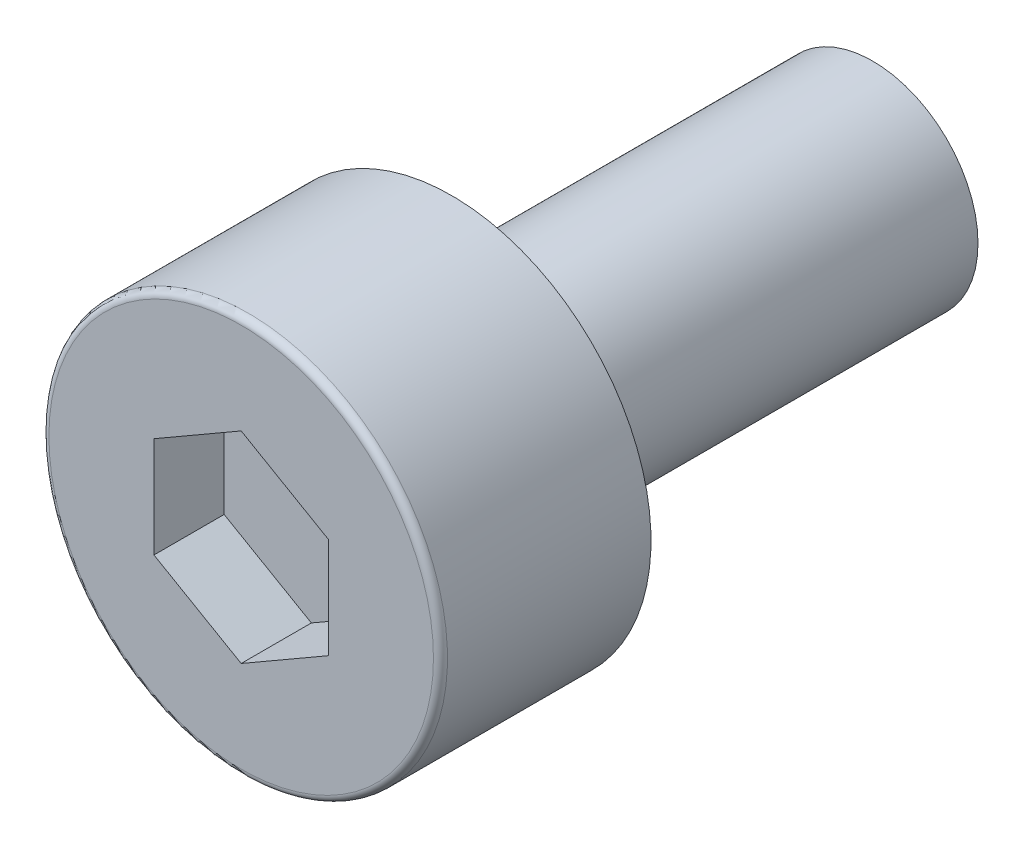
ISO-10303-21;
HEADER;
FILE_DESCRIPTION(('STEP AP214'),'2;1');
FILE_NAME('part.step','',(''),(''),'','','');
FILE_SCHEMA(('AUTOMOTIVE_DESIGN { 1 0 10303 214 1 1 1 1 }'));
ENDSEC;
DATA;
#1=APPLICATION_CONTEXT('core data for automotive mechanical design processes');
#2=APPLICATION_PROTOCOL_DEFINITION('international standard','automotive_design',2000,#1);
#3=PRODUCT_CONTEXT('',#1,'mechanical');
#4=PRODUCT('Part','Part','',(#3));
#5=PRODUCT_RELATED_PRODUCT_CATEGORY('part','',(#4));
#6=PRODUCT_DEFINITION_FORMATION('','',#4);
#7=PRODUCT_DEFINITION_CONTEXT('part definition',#1,'design');
#8=PRODUCT_DEFINITION('design','',#6,#7);
#9=PRODUCT_DEFINITION_SHAPE('','',#8);
#10=(LENGTH_UNIT() NAMED_UNIT(*) SI_UNIT(.MILLI.,.METRE.));
#11=(NAMED_UNIT(*) PLANE_ANGLE_UNIT() SI_UNIT($,.RADIAN.));
#12=(NAMED_UNIT(*) SI_UNIT($,.STERADIAN.) SOLID_ANGLE_UNIT());
#13=UNCERTAINTY_MEASURE_WITH_UNIT(LENGTH_MEASURE(1.E-05),#10,'distance_accuracy_value','');
#14=(GEOMETRIC_REPRESENTATION_CONTEXT(3) GLOBAL_UNCERTAINTY_ASSIGNED_CONTEXT((#13)) GLOBAL_UNIT_ASSIGNED_CONTEXT((#10,
#11,#12)) REPRESENTATION_CONTEXT('',''));
#15=CARTESIAN_POINT('',(0.,0.,0.));
#16=DIRECTION('',(0.,0.,1.));
#17=DIRECTION('',(1.,0.,0.));
#18=AXIS2_PLACEMENT_3D('',#15,#16,#17);
#19=CARTESIAN_POINT('',(0.,0.,2.));
#20=DIRECTION('',(0.,0.,1.));
#21=DIRECTION('',(1.,0.,0.));
#22=AXIS2_PLACEMENT_3D('',#19,#20,#21);
#23=PLANE('',#22);
#24=DIRECTION('',(-0.866025403784439,-0.5,0.));
#25=VECTOR('',#24,1.);
#26=CARTESIAN_POINT('',(0.,1.435,2.));
#27=LINE('',#26,#25);
#28=CARTESIAN_POINT('',(0.,1.435,2.));
#29=VERTEX_POINT('',#28);
#30=CARTESIAN_POINT('',(-1.24274645443067,0.7175,2.));
#31=VERTEX_POINT('',#30);
#32=EDGE_CURVE('E61',#29,#31,#27,.T.);
#33=ORIENTED_EDGE('',*,*,#32,.T.);
#34=DIRECTION('',(0.,-1.,0.));
#35=VECTOR('',#34,1.);
#36=CARTESIAN_POINT('',(-1.24274645443067,0.7175,2.));
#37=LINE('',#36,#35);
#38=CARTESIAN_POINT('',(-1.24274645443067,-0.7175,2.));
#39=VERTEX_POINT('',#38);
#40=EDGE_CURVE('E63',#31,#39,#37,.T.);
#41=ORIENTED_EDGE('',*,*,#40,.T.);
#42=DIRECTION('',(0.866025403784439,-0.5,0.));
#43=VECTOR('',#42,1.);
#44=CARTESIAN_POINT('',(-1.24274645443067,-0.7175,2.));
#45=LINE('',#44,#43);
#46=CARTESIAN_POINT('',(0.,-1.435,2.));
#47=VERTEX_POINT('',#46);
#48=EDGE_CURVE('E65',#39,#47,#45,.T.);
#49=ORIENTED_EDGE('',*,*,#48,.T.);
#50=DIRECTION('',(0.866025403784439,0.5,0.));
#51=VECTOR('',#50,1.);
#52=CARTESIAN_POINT('',(0.,-1.435,2.));
#53=LINE('',#52,#51);
#54=CARTESIAN_POINT('',(1.24274645443067,-0.717500000000001,2.));
#55=VERTEX_POINT('',#54);
#56=EDGE_CURVE('E134',#47,#55,#53,.T.);
#57=ORIENTED_EDGE('',*,*,#56,.T.);
#58=DIRECTION('',(0.,1.,0.));
#59=VECTOR('',#58,1.);
#60=CARTESIAN_POINT('',(1.24274645443067,-0.7175,2.));
#61=LINE('',#60,#59);
#62=CARTESIAN_POINT('',(1.24274645443067,0.7175,2.));
#63=VERTEX_POINT('',#62);
#64=EDGE_CURVE('E140',#55,#63,#61,.T.);
#65=ORIENTED_EDGE('',*,*,#64,.T.);
#66=DIRECTION('',(-0.866025403784439,0.5,0.));
#67=VECTOR('',#66,1.);
#68=CARTESIAN_POINT('',(1.24274645443067,0.717500000000001,2.));
#69=LINE('',#68,#67);
#70=EDGE_CURVE('E145',#63,#29,#69,.T.);
#71=ORIENTED_EDGE('',*,*,#70,.T.);
#72=EDGE_LOOP('',(#33,#41,#49,#57,#65,#71));
#73=FACE_BOUND('',#72,.T.);
#74=ADVANCED_FACE('F17',(#73),#23,.T.);
#75=CARTESIAN_POINT('',(-1.24274645443067,-0.7175,2.));
#76=DIRECTION('',(-0.5,-0.866025403784439,0.));
#77=DIRECTION('',(0.866025403784439,-0.5,0.));
#78=AXIS2_PLACEMENT_3D('',#75,#76,#77);
#79=PLANE('',#78);
#80=DIRECTION('',(0.,0.,1.));
#81=VECTOR('',#80,1.);
#82=CARTESIAN_POINT('',(0.,-1.435,2.));
#83=LINE('',#82,#81);
#84=CARTESIAN_POINT('',(0.,-1.435,3.));
#85=VERTEX_POINT('',#84);
#86=EDGE_CURVE('E79',#85,#47,#83,.F.);
#87=ORIENTED_EDGE('',*,*,#86,.T.);
#88=ORIENTED_EDGE('',*,*,#48,.F.);
#89=DIRECTION('',(0.,0.,1.));
#90=VECTOR('',#89,1.);
#91=CARTESIAN_POINT('',(-1.24274645443067,-0.7175,2.));
#92=LINE('',#91,#90);
#93=CARTESIAN_POINT('',(-1.24274645443067,-0.7175,3.));
#94=VERTEX_POINT('',#93);
#95=EDGE_CURVE('E71',#39,#94,#92,.T.);
#96=ORIENTED_EDGE('',*,*,#95,.T.);
#97=DIRECTION('',(-0.866025403784438,0.5,0.));
#98=VECTOR('',#97,1.);
#99=CARTESIAN_POINT('',(0.,-1.435,3.));
#100=LINE('',#99,#98);
#101=EDGE_CURVE('E133',#85,#94,#100,.T.);
#102=ORIENTED_EDGE('',*,*,#101,.F.);
#103=EDGE_LOOP('',(#87,#88,#96,#102));
#104=FACE_BOUND('',#103,.T.);
#105=ADVANCED_FACE('F75',(#104),#79,.F.);
#106=CARTESIAN_POINT('',(-1.24274645443067,0.7175,2.));
#107=DIRECTION('',(-1.,0.,0.));
#108=DIRECTION('',(0.,-1.,0.));
#109=AXIS2_PLACEMENT_3D('',#106,#107,#108);
#110=PLANE('',#109);
#111=ORIENTED_EDGE('',*,*,#95,.F.);
#112=ORIENTED_EDGE('',*,*,#40,.F.);
#113=DIRECTION('',(0.,0.,1.));
#114=VECTOR('',#113,1.);
#115=CARTESIAN_POINT('',(-1.24274645443067,0.7175,2.));
#116=LINE('',#115,#114);
#117=CARTESIAN_POINT('',(-1.24274645443067,0.7175,3.));
#118=VERTEX_POINT('',#117);
#119=EDGE_CURVE('E87',#31,#118,#116,.T.);
#120=ORIENTED_EDGE('',*,*,#119,.T.);
#121=DIRECTION('',(0.,1.,0.));
#122=VECTOR('',#121,1.);
#123=CARTESIAN_POINT('',(-1.24274645443067,0.,3.));
#124=LINE('',#123,#122);
#125=EDGE_CURVE('E84',#94,#118,#124,.T.);
#126=ORIENTED_EDGE('',*,*,#125,.F.);
#127=EDGE_LOOP('',(#111,#112,#120,#126));
#128=FACE_BOUND('',#127,.T.);
#129=ADVANCED_FACE('F82',(#128),#110,.F.);
#130=CARTESIAN_POINT('',(0.,1.435,2.));
#131=DIRECTION('',(-0.5,0.866025403784439,0.));
#132=DIRECTION('',(-0.866025403784439,-0.5,0.));
#133=AXIS2_PLACEMENT_3D('',#130,#131,#132);
#134=PLANE('',#133);
#135=ORIENTED_EDGE('',*,*,#119,.F.);
#136=ORIENTED_EDGE('',*,*,#32,.F.);
#137=DIRECTION('',(0.,0.,1.));
#138=VECTOR('',#137,1.);
#139=CARTESIAN_POINT('',(0.,1.435,2.));
#140=LINE('',#139,#138);
#141=CARTESIAN_POINT('',(0.,1.435,3.));
#142=VERTEX_POINT('',#141);
#143=EDGE_CURVE('E142',#29,#142,#140,.T.);
#144=ORIENTED_EDGE('',*,*,#143,.T.);
#145=DIRECTION('',(0.866025403784439,0.5,0.));
#146=VECTOR('',#145,1.);
#147=CARTESIAN_POINT('',(-1.24274645443067,0.7175,3.));
#148=LINE('',#147,#146);
#149=EDGE_CURVE('E152',#118,#142,#148,.T.);
#150=ORIENTED_EDGE('',*,*,#149,.F.);
#151=EDGE_LOOP('',(#135,#136,#144,#150));
#152=FACE_BOUND('',#151,.T.);
#153=ADVANCED_FACE('F153',(#152),#134,.F.);
#154=CARTESIAN_POINT('',(1.24274645443067,0.717500000000001,2.));
#155=DIRECTION('',(0.5,0.866025403784439,0.));
#156=DIRECTION('',(-0.866025403784439,0.5,0.));
#157=AXIS2_PLACEMENT_3D('',#154,#155,#156);
#158=PLANE('',#157);
#159=ORIENTED_EDGE('',*,*,#143,.F.);
#160=ORIENTED_EDGE('',*,*,#70,.F.);
#161=DIRECTION('',(0.,0.,1.));
#162=VECTOR('',#161,1.);
#163=CARTESIAN_POINT('',(1.24274645443067,0.717500000000001,2.));
#164=LINE('',#163,#162);
#165=CARTESIAN_POINT('',(1.24274645443067,0.717500000000001,3.));
#166=VERTEX_POINT('',#165);
#167=EDGE_CURVE('E137',#63,#166,#164,.T.);
#168=ORIENTED_EDGE('',*,*,#167,.T.);
#169=DIRECTION('',(0.866025403784439,-0.5,0.));
#170=VECTOR('',#169,1.);
#171=CARTESIAN_POINT('',(0.,1.435,3.));
#172=LINE('',#171,#170);
#173=EDGE_CURVE('E158',#142,#166,#172,.T.);
#174=ORIENTED_EDGE('',*,*,#173,.F.);
#175=EDGE_LOOP('',(#159,#160,#168,#174));
#176=FACE_BOUND('',#175,.T.);
#177=ADVANCED_FACE('F241',(#176),#158,.F.);
#178=CARTESIAN_POINT('',(1.24274645443067,-0.7175,2.));
#179=DIRECTION('',(1.,0.,0.));
#180=DIRECTION('',(0.,1.,0.));
#181=AXIS2_PLACEMENT_3D('',#178,#179,#180);
#182=PLANE('',#181);
#183=ORIENTED_EDGE('',*,*,#167,.F.);
#184=ORIENTED_EDGE('',*,*,#64,.F.);
#185=DIRECTION('',(0.,0.,1.));
#186=VECTOR('',#185,1.);
#187=CARTESIAN_POINT('',(1.24274645443067,-0.717500000000001,2.));
#188=LINE('',#187,#186);
#189=CARTESIAN_POINT('',(1.24274645443067,-0.717500000000001,3.));
#190=VERTEX_POINT('',#189);
#191=EDGE_CURVE('E125',#55,#190,#188,.T.);
#192=ORIENTED_EDGE('',*,*,#191,.T.);
#193=DIRECTION('',(0.,1.,0.));
#194=VECTOR('',#193,1.);
#195=CARTESIAN_POINT('',(1.24274645443067,0.,3.));
#196=LINE('',#195,#194);
#197=EDGE_CURVE('E166',#166,#190,#196,.F.);
#198=ORIENTED_EDGE('',*,*,#197,.F.);
#199=EDGE_LOOP('',(#183,#184,#192,#198));
#200=FACE_BOUND('',#199,.T.);
#201=ADVANCED_FACE('F191',(#200),#182,.F.);
#202=CARTESIAN_POINT('',(0.,-1.435,2.));
#203=DIRECTION('',(0.5,-0.866025403784439,0.));
#204=DIRECTION('',(0.866025403784439,0.5,0.));
#205=AXIS2_PLACEMENT_3D('',#202,#203,#204);
#206=PLANE('',#205);
#207=ORIENTED_EDGE('',*,*,#191,.F.);
#208=ORIENTED_EDGE('',*,*,#56,.F.);
#209=ORIENTED_EDGE('',*,*,#86,.F.);
#210=DIRECTION('',(-0.866025403784439,-0.5,0.));
#211=VECTOR('',#210,1.);
#212=CARTESIAN_POINT('',(1.24274645443067,-0.7175,3.));
#213=LINE('',#212,#211);
#214=EDGE_CURVE('E168',#190,#85,#213,.T.);
#215=ORIENTED_EDGE('',*,*,#214,.F.);
#216=EDGE_LOOP('',(#207,#208,#209,#215));
#217=FACE_BOUND('',#216,.T.);
#218=ADVANCED_FACE('F186',(#217),#206,.F.);
#219=CARTESIAN_POINT('',(0.,0.,3.));
#220=DIRECTION('',(0.,0.,1.));
#221=DIRECTION('',(1.,0.,0.));
#222=AXIS2_PLACEMENT_3D('',#219,#220,#221);
#223=PLANE('',#222);
#224=ORIENTED_EDGE('',*,*,#197,.T.);
#225=ORIENTED_EDGE('',*,*,#214,.T.);
#226=ORIENTED_EDGE('',*,*,#101,.T.);
#227=ORIENTED_EDGE('',*,*,#125,.T.);
#228=ORIENTED_EDGE('',*,*,#149,.T.);
#229=ORIENTED_EDGE('',*,*,#173,.T.);
#230=EDGE_LOOP('',(#224,#225,#226,#227,#228,#229));
#231=FACE_BOUND('',#230,.T.);
#232=CARTESIAN_POINT('',(0.,0.,3.));
#233=DIRECTION('',(0.,0.,-1.));
#234=DIRECTION('',(-1.,0.,0.));
#235=AXIS2_PLACEMENT_3D('',#232,#233,#234);
#236=CIRCLE('',#235,2.74);
#237=CARTESIAN_POINT('',(-2.74,0.,3.));
#238=VERTEX_POINT('',#237);
#239=CARTESIAN_POINT('',(2.74,0.,3.));
#240=VERTEX_POINT('',#239);
#241=EDGE_CURVE('E36',#238,#240,#236,.T.);
#242=ORIENTED_EDGE('',*,*,#241,.F.);
#243=CARTESIAN_POINT('',(0.,0.,3.));
#244=DIRECTION('',(0.,0.,-1.));
#245=DIRECTION('',(1.,0.,0.));
#246=AXIS2_PLACEMENT_3D('',#243,#244,#245);
#247=CIRCLE('',#246,2.74);
#248=EDGE_CURVE('E99',#240,#238,#247,.T.);
#249=ORIENTED_EDGE('',*,*,#248,.F.);
#250=EDGE_LOOP('',(#242,#249));
#251=FACE_BOUND('',#250,.T.);
#252=ADVANCED_FACE('F113',(#231,#251),#223,.T.);
#253=CARTESIAN_POINT('',(0.,0.,2.9));
#254=DIRECTION('',(0.,0.,1.));
#255=DIRECTION('',(1.,0.,0.));
#256=AXIS2_PLACEMENT_3D('',#253,#254,#255);
#257=TOROIDAL_SURFACE('',#256,2.74,0.1);
#258=CARTESIAN_POINT('',(0.,0.,2.9));
#259=DIRECTION('',(0.,0.,-1.));
#260=DIRECTION('',(-1.,0.,0.));
#261=AXIS2_PLACEMENT_3D('',#258,#259,#260);
#262=CIRCLE('',#261,2.84);
#263=CARTESIAN_POINT('',(-2.84,0.,2.9));
#264=VERTEX_POINT('',#263);
#265=EDGE_CURVE('E95',#264,#264,#262,.T.);
#266=ORIENTED_EDGE('',*,*,#265,.F.);
#267=EDGE_LOOP('',(#266));
#268=FACE_BOUND('',#267,.T.);
#269=ORIENTED_EDGE('',*,*,#248,.T.);
#270=ORIENTED_EDGE('',*,*,#241,.T.);
#271=EDGE_LOOP('',(#269,#270));
#272=FACE_BOUND('',#271,.T.);
#273=ADVANCED_FACE('F107',(#268,#272),#257,.T.);
#274=CARTESIAN_POINT('',(0.,0.,3.));
#275=DIRECTION('',(0.,0.,-1.));
#276=DIRECTION('',(-1.,0.,0.));
#277=AXIS2_PLACEMENT_3D('',#274,#275,#276);
#278=CYLINDRICAL_SURFACE('',#277,2.84);
#279=ORIENTED_EDGE('',*,*,#265,.T.);
#280=EDGE_LOOP('',(#279));
#281=FACE_BOUND('',#280,.T.);
#282=CARTESIAN_POINT('',(0.,0.,0.));
#283=DIRECTION('',(0.,0.,-1.));
#284=DIRECTION('',(-1.,0.,0.));
#285=AXIS2_PLACEMENT_3D('',#282,#283,#284);
#286=CIRCLE('',#285,2.84);
#287=CARTESIAN_POINT('',(-2.84,0.,0.));
#288=VERTEX_POINT('',#287);
#289=EDGE_CURVE('E93',#288,#288,#286,.F.);
#290=ORIENTED_EDGE('',*,*,#289,.T.);
#291=EDGE_LOOP('',(#290));
#292=FACE_BOUND('',#291,.T.);
#293=ADVANCED_FACE('F112',(#281,#292),#278,.T.);
#294=CARTESIAN_POINT('',(0.,0.,-6.));
#295=DIRECTION('',(0.,0.,-1.));
#296=DIRECTION('',(-1.,0.,0.));
#297=AXIS2_PLACEMENT_3D('',#294,#295,#296);
#298=PLANE('',#297);
#299=CARTESIAN_POINT('',(0.,0.,-6.));
#300=DIRECTION('',(0.,0.,1.));
#301=DIRECTION('',(1.,0.,0.));
#302=AXIS2_PLACEMENT_3D('',#299,#300,#301);
#303=CIRCLE('',#302,1.5);
#304=CARTESIAN_POINT('',(1.5,0.,-6.));
#305=VERTEX_POINT('',#304);
#306=EDGE_CURVE('E28',#305,#305,#303,.T.);
#307=ORIENTED_EDGE('',*,*,#306,.F.);
#308=EDGE_LOOP('',(#307));
#309=FACE_BOUND('',#308,.T.);
#310=ADVANCED_FACE('F201',(#309),#298,.T.);
#311=CARTESIAN_POINT('',(0.,0.,0.));
#312=DIRECTION('',(0.,0.,1.));
#313=DIRECTION('',(1.,0.,0.));
#314=AXIS2_PLACEMENT_3D('',#311,#312,#313);
#315=PLANE('',#314);
#316=CARTESIAN_POINT('',(0.,0.,0.));
#317=DIRECTION('',(0.,0.,1.));
#318=DIRECTION('',(1.,0.,0.));
#319=AXIS2_PLACEMENT_3D('',#316,#317,#318);
#320=CIRCLE('',#319,1.5);
#321=CARTESIAN_POINT('',(1.5,0.,0.));
#322=VERTEX_POINT('',#321);
#323=EDGE_CURVE('E11',#322,#322,#320,.F.);
#324=ORIENTED_EDGE('',*,*,#323,.F.);
#325=EDGE_LOOP('',(#324));
#326=FACE_BOUND('',#325,.T.);
#327=ORIENTED_EDGE('',*,*,#289,.F.);
#328=EDGE_LOOP('',(#327));
#329=FACE_BOUND('',#328,.T.);
#330=ADVANCED_FACE('F195',(#326,#329),#315,.F.);
#331=CARTESIAN_POINT('',(0.,0.,-6.));
#332=DIRECTION('',(0.,0.,1.));
#333=DIRECTION('',(1.,0.,0.));
#334=AXIS2_PLACEMENT_3D('',#331,#332,#333);
#335=CYLINDRICAL_SURFACE('',#334,1.5);
#336=ORIENTED_EDGE('',*,*,#323,.T.);
#337=EDGE_LOOP('',(#336));
#338=FACE_BOUND('',#337,.T.);
#339=ORIENTED_EDGE('',*,*,#306,.T.);
#340=EDGE_LOOP('',(#339));
#341=FACE_BOUND('',#340,.T.);
#342=ADVANCED_FACE('F193',(#338,#341),#335,.T.);
#343=CLOSED_SHELL('',(#74,#105,#129,#153,#177,#201,#218,#252,#273,#293,#310,#330,#342));
#344=MANIFOLD_SOLID_BREP('B1',#343);
#345=ADVANCED_BREP_SHAPE_REPRESENTATION('',(#18,#344),#14);
#346=SHAPE_DEFINITION_REPRESENTATION(#9,#345);
ENDSEC;
END-ISO-10303-21;
